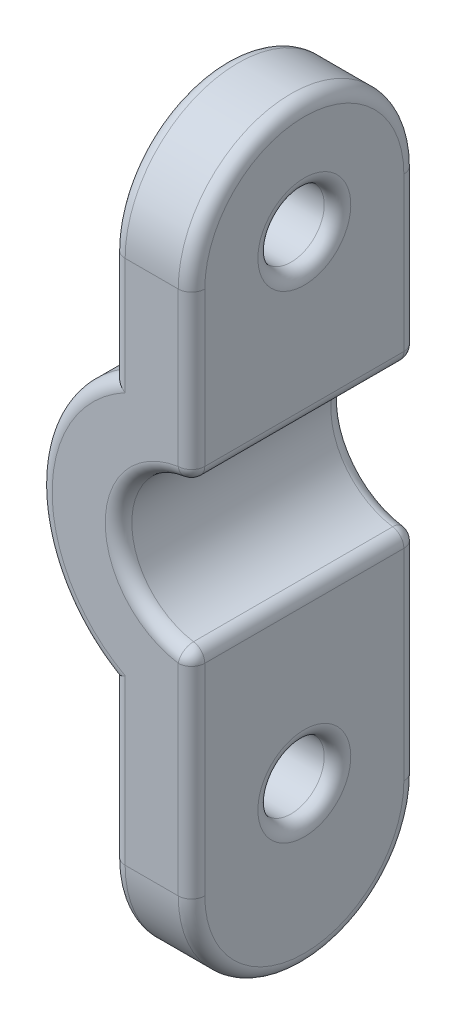
ISO-10303-21;
HEADER;
FILE_DESCRIPTION(('STEP AP214'),'2;1');
FILE_NAME('part.step','',(''),(''),'','','');
FILE_SCHEMA(('AUTOMOTIVE_DESIGN { 1 0 10303 214 1 1 1 1 }'));
ENDSEC;
DATA;
#1=APPLICATION_CONTEXT('core data for automotive mechanical design processes');
#2=APPLICATION_PROTOCOL_DEFINITION('international standard','automotive_design',2000,#1);
#3=PRODUCT_CONTEXT('',#1,'mechanical');
#4=PRODUCT('Part','Part','',(#3));
#5=PRODUCT_RELATED_PRODUCT_CATEGORY('part','',(#4));
#6=PRODUCT_DEFINITION_FORMATION('','',#4);
#7=PRODUCT_DEFINITION_CONTEXT('part definition',#1,'design');
#8=PRODUCT_DEFINITION('design','',#6,#7);
#9=PRODUCT_DEFINITION_SHAPE('','',#8);
#10=(LENGTH_UNIT() NAMED_UNIT(*) SI_UNIT(.MILLI.,.METRE.));
#11=(NAMED_UNIT(*) PLANE_ANGLE_UNIT() SI_UNIT($,.RADIAN.));
#12=(NAMED_UNIT(*) SI_UNIT($,.STERADIAN.) SOLID_ANGLE_UNIT());
#13=UNCERTAINTY_MEASURE_WITH_UNIT(LENGTH_MEASURE(1.E-05),#10,'distance_accuracy_value','');
#14=(GEOMETRIC_REPRESENTATION_CONTEXT(3) GLOBAL_UNCERTAINTY_ASSIGNED_CONTEXT((#13)) GLOBAL_UNIT_ASSIGNED_CONTEXT((#10,
#11,#12)) REPRESENTATION_CONTEXT('',''));
#15=CARTESIAN_POINT('',(0.,0.,0.));
#16=DIRECTION('',(0.,0.,1.));
#17=DIRECTION('',(1.,0.,0.));
#18=AXIS2_PLACEMENT_3D('',#15,#16,#17);
#19=CARTESIAN_POINT('',(-2.75,0.,12.5));
#20=DIRECTION('',(-1.,0.,0.));
#21=DIRECTION('',(0.,-1.,0.));
#22=AXIS2_PLACEMENT_3D('',#19,#20,#21);
#23=PLANE('',#22);
#24=CARTESIAN_POINT('',(-2.75,-8.10000000000002,6.25000000000001));
#25=DIRECTION('',(-1.,0.,0.));
#26=DIRECTION('',(0.,-1.,0.));
#27=AXIS2_PLACEMENT_3D('',#24,#25,#26);
#28=CIRCLE('',#27,1.75);
#29=CARTESIAN_POINT('',(-2.74999999999999,-9.85000000000002,6.25000000000001));
#30=VERTEX_POINT('',#29);
#31=EDGE_CURVE('E221',#30,#30,#28,.T.);
#32=ORIENTED_EDGE('',*,*,#31,.T.);
#33=EDGE_LOOP('',(#32));
#34=FACE_BOUND('',#33,.T.);
#35=DIRECTION('',(0.,0.,1.));
#36=VECTOR('',#35,1.);
#37=CARTESIAN_POINT('',(-2.75,-2.31130814466627,10.5));
#38=LINE('',#37,#36);
#39=CARTESIAN_POINT('',(-2.75,-2.31130814466627,2.5));
#40=VERTEX_POINT('',#39);
#41=CARTESIAN_POINT('',(-2.75,-2.31130814466627,10.));
#42=VERTEX_POINT('',#41);
#43=EDGE_CURVE('E263',#40,#42,#38,.T.);
#44=ORIENTED_EDGE('',*,*,#43,.T.);
#45=DIRECTION('',(0.,1.,0.));
#46=VECTOR('',#45,1.);
#47=CARTESIAN_POINT('',(-2.74999999999999,-9.89999999999998,10.));
#48=LINE('',#47,#46);
#49=CARTESIAN_POINT('',(-2.74999999999999,-9.89999999999998,10.));
#50=VERTEX_POINT('',#49);
#51=EDGE_CURVE('E267',#42,#50,#48,.F.);
#52=ORIENTED_EDGE('',*,*,#51,.T.);
#53=CARTESIAN_POINT('',(-2.74999999999999,-9.89999999999998,6.25));
#54=DIRECTION('',(-1.,0.,0.));
#55=DIRECTION('',(0.,-1.,0.));
#56=AXIS2_PLACEMENT_3D('',#53,#54,#55);
#57=CIRCLE('',#56,3.75);
#58=CARTESIAN_POINT('',(-2.74999999999999,-9.89999999999998,2.5));
#59=VERTEX_POINT('',#58);
#60=EDGE_CURVE('E265',#50,#59,#57,.F.);
#61=ORIENTED_EDGE('',*,*,#60,.T.);
#62=DIRECTION('',(0.,1.,0.));
#63=VECTOR('',#62,1.);
#64=CARTESIAN_POINT('',(-2.75,0.,2.5));
#65=LINE('',#64,#63);
#66=EDGE_CURVE('E261',#59,#40,#65,.T.);
#67=ORIENTED_EDGE('',*,*,#66,.T.);
#68=EDGE_LOOP('',(#44,#52,#61,#67));
#69=FACE_BOUND('',#68,.T.);
#70=ADVANCED_FACE('F65',(#34,#69),#23,.F.);
#71=CARTESIAN_POINT('',(-2.75,0.,12.5));
#72=DIRECTION('',(1.,0.,0.));
#73=DIRECTION('',(0.,1.,0.));
#74=AXIS2_PLACEMENT_3D('',#71,#72,#73);
#75=PLANE('',#74);
#76=CARTESIAN_POINT('',(-2.75,9.89999999999998,6.25000000000001));
#77=DIRECTION('',(1.,0.,0.));
#78=DIRECTION('',(0.,1.,0.));
#79=AXIS2_PLACEMENT_3D('',#76,#77,#78);
#80=CIRCLE('',#79,1.75);
#81=CARTESIAN_POINT('',(-2.75,11.65,6.25000000000001));
#82=VERTEX_POINT('',#81);
#83=EDGE_CURVE('E282',#82,#82,#80,.F.);
#84=ORIENTED_EDGE('',*,*,#83,.T.);
#85=EDGE_LOOP('',(#84));
#86=FACE_BOUND('',#85,.T.);
#87=CARTESIAN_POINT('',(-2.75,9.89999999999998,6.25000000000001));
#88=DIRECTION('',(1.,0.,0.));
#89=DIRECTION('',(0.,1.,0.));
#90=AXIS2_PLACEMENT_3D('',#87,#88,#89);
#91=CIRCLE('',#90,3.75);
#92=CARTESIAN_POINT('',(-2.75,9.89999999999998,2.50000000000001));
#93=VERTEX_POINT('',#92);
#94=CARTESIAN_POINT('',(-2.75,9.89999999999998,10.));
#95=VERTEX_POINT('',#94);
#96=EDGE_CURVE('E277',#93,#95,#91,.T.);
#97=ORIENTED_EDGE('',*,*,#96,.T.);
#98=DIRECTION('',(0.,-1.,0.));
#99=VECTOR('',#98,1.);
#100=CARTESIAN_POINT('',(-2.75,0.,10.));
#101=LINE('',#100,#99);
#102=CARTESIAN_POINT('',(-2.75,4.11130814466629,10.));
#103=VERTEX_POINT('',#102);
#104=EDGE_CURVE('E279',#95,#103,#101,.T.);
#105=ORIENTED_EDGE('',*,*,#104,.T.);
#106=DIRECTION('',(0.,0.,-1.));
#107=VECTOR('',#106,1.);
#108=CARTESIAN_POINT('',(-2.75,4.11130814466629,12.5));
#109=LINE('',#108,#107);
#110=CARTESIAN_POINT('',(-2.75,4.11130814466629,2.5));
#111=VERTEX_POINT('',#110);
#112=EDGE_CURVE('E275',#103,#111,#109,.T.);
#113=ORIENTED_EDGE('',*,*,#112,.T.);
#114=DIRECTION('',(0.,-1.,0.));
#115=VECTOR('',#114,1.);
#116=CARTESIAN_POINT('',(-2.75,9.89999999999998,2.50000000000001));
#117=LINE('',#116,#115);
#118=EDGE_CURVE('E273',#111,#93,#117,.F.);
#119=ORIENTED_EDGE('',*,*,#118,.T.);
#120=EDGE_LOOP('',(#97,#105,#113,#119));
#121=FACE_BOUND('',#120,.T.);
#122=ADVANCED_FACE('F446',(#86,#121),#75,.T.);
#123=CARTESIAN_POINT('',(-2.75,0.900000000000008,12.5));
#124=DIRECTION('',(0.,0.,-1.));
#125=DIRECTION('',(-1.,0.,0.));
#126=AXIS2_PLACEMENT_3D('',#123,#124,#125);
#127=CYLINDRICAL_SURFACE('',#126,2.75);
#128=DIRECTION('',(0.,0.,-1.));
#129=VECTOR('',#128,1.);
#130=CARTESIAN_POINT('',(-3.17307692307692,3.61726073779455,12.5));
#131=LINE('',#130,#129);
#132=CARTESIAN_POINT('',(-3.17307692307692,3.61726073779455,2.5));
#133=VERTEX_POINT('',#132);
#134=CARTESIAN_POINT('',(-3.17307692307692,3.61726073779455,10.));
#135=VERTEX_POINT('',#134);
#136=EDGE_CURVE('E93',#133,#135,#131,.F.);
#137=ORIENTED_EDGE('',*,*,#136,.T.);
#138=CARTESIAN_POINT('',(-2.75,0.900000000000008,10.));
#139=DIRECTION('',(0.,0.,1.));
#140=DIRECTION('',(0.,-1.,0.));
#141=AXIS2_PLACEMENT_3D('',#138,#139,#140);
#142=CIRCLE('',#141,2.75);
#143=CARTESIAN_POINT('',(-3.17307692307692,-1.81726073779454,10.));
#144=VERTEX_POINT('',#143);
#145=EDGE_CURVE('E88',#135,#144,#142,.T.);
#146=ORIENTED_EDGE('',*,*,#145,.T.);
#147=DIRECTION('',(0.,0.,-1.));
#148=VECTOR('',#147,1.);
#149=CARTESIAN_POINT('',(-3.17307692307692,-1.81726073779454,12.5));
#150=LINE('',#149,#148);
#151=CARTESIAN_POINT('',(-3.17307692307692,-1.81726073779454,2.5));
#152=VERTEX_POINT('',#151);
#153=EDGE_CURVE('E321',#144,#152,#150,.T.);
#154=ORIENTED_EDGE('',*,*,#153,.T.);
#155=CARTESIAN_POINT('',(-2.75,0.900000000000008,2.5));
#156=DIRECTION('',(0.,0.,1.));
#157=DIRECTION('',(0.,-1.,0.));
#158=AXIS2_PLACEMENT_3D('',#155,#156,#157);
#159=CIRCLE('',#158,2.75);
#160=EDGE_CURVE('E318',#152,#133,#159,.F.);
#161=ORIENTED_EDGE('',*,*,#160,.T.);
#162=EDGE_LOOP('',(#137,#146,#154,#161));
#163=FACE_BOUND('',#162,.T.);
#164=ADVANCED_FACE('F452',(#163),#127,.F.);
#165=CARTESIAN_POINT('',(-8.5,9.89999999999998,6.25000000000001));
#166=DIRECTION('',(1.,0.,0.));
#167=DIRECTION('',(0.,0.,-1.));
#168=AXIS2_PLACEMENT_3D('',#165,#166,#167);
#169=CYLINDRICAL_SURFACE('',#168,4.25);
#170=DIRECTION('',(1.,0.,0.));
#171=VECTOR('',#170,1.);
#172=CARTESIAN_POINT('',(-8.5,9.89999999999998,10.5));
#173=LINE('',#172,#171);
#174=CARTESIAN_POINT('',(-5.25,9.89999999999998,10.5));
#175=VERTEX_POINT('',#174);
#176=CARTESIAN_POINT('',(-3.25,9.89999999999998,10.5));
#177=VERTEX_POINT('',#176);
#178=EDGE_CURVE('E236',#175,#177,#173,.T.);
#179=ORIENTED_EDGE('',*,*,#178,.T.);
#180=CARTESIAN_POINT('',(-3.25,9.89999999999998,6.25000000000001));
#181=DIRECTION('',(1.,0.,0.));
#182=DIRECTION('',(0.,1.,0.));
#183=AXIS2_PLACEMENT_3D('',#180,#181,#182);
#184=CIRCLE('',#183,4.25);
#185=CARTESIAN_POINT('',(-3.25,9.89999999999998,2.00000000000001));
#186=VERTEX_POINT('',#185);
#187=EDGE_CURVE('E287',#177,#186,#184,.F.);
#188=ORIENTED_EDGE('',*,*,#187,.T.);
#189=DIRECTION('',(1.,0.,0.));
#190=VECTOR('',#189,1.);
#191=CARTESIAN_POINT('',(-8.5,9.89999999999998,2.00000000000001));
#192=LINE('',#191,#190);
#193=CARTESIAN_POINT('',(-5.25,9.89999999999998,2.00000000000001));
#194=VERTEX_POINT('',#193);
#195=EDGE_CURVE('E240',#194,#186,#192,.T.);
#196=ORIENTED_EDGE('',*,*,#195,.F.);
#197=CARTESIAN_POINT('',(-5.25,9.89999999999998,6.25000000000001));
#198=DIRECTION('',(1.,0.,0.));
#199=DIRECTION('',(0.,1.,0.));
#200=AXIS2_PLACEMENT_3D('',#197,#198,#199);
#201=CIRCLE('',#200,4.25);
#202=EDGE_CURVE('E285',#194,#175,#201,.T.);
#203=ORIENTED_EDGE('',*,*,#202,.T.);
#204=EDGE_LOOP('',(#179,#188,#196,#203));
#205=FACE_BOUND('',#204,.T.);
#206=ADVANCED_FACE('F475',(#205),#169,.T.);
#207=CARTESIAN_POINT('',(-8.5,-9.89999999999998,6.25));
#208=DIRECTION('',(1.,0.,0.));
#209=DIRECTION('',(0.,0.,-1.));
#210=AXIS2_PLACEMENT_3D('',#207,#208,#209);
#211=CYLINDRICAL_SURFACE('',#210,4.25);
#212=DIRECTION('',(1.,0.,0.));
#213=VECTOR('',#212,1.);
#214=CARTESIAN_POINT('',(-8.5,-9.89999999999998,2.));
#215=LINE('',#214,#213);
#216=CARTESIAN_POINT('',(-5.24999999999999,-9.89999999999998,2.));
#217=VERTEX_POINT('',#216);
#218=CARTESIAN_POINT('',(-3.24999999999999,-9.89999999999998,2.));
#219=VERTEX_POINT('',#218);
#220=EDGE_CURVE('E251',#217,#219,#215,.T.);
#221=ORIENTED_EDGE('',*,*,#220,.T.);
#222=CARTESIAN_POINT('',(-3.24999999999999,-9.89999999999998,6.25));
#223=DIRECTION('',(-1.,0.,0.));
#224=DIRECTION('',(0.,-1.,0.));
#225=AXIS2_PLACEMENT_3D('',#222,#223,#224);
#226=CIRCLE('',#225,4.25);
#227=CARTESIAN_POINT('',(-3.24999999999999,-9.89999999999998,10.5));
#228=VERTEX_POINT('',#227);
#229=EDGE_CURVE('E220',#219,#228,#226,.T.);
#230=ORIENTED_EDGE('',*,*,#229,.T.);
#231=DIRECTION('',(1.,0.,0.));
#232=VECTOR('',#231,1.);
#233=CARTESIAN_POINT('',(-8.5,-9.89999999999998,10.5));
#234=LINE('',#233,#232);
#235=CARTESIAN_POINT('',(-5.24999999999999,-9.89999999999998,10.5));
#236=VERTEX_POINT('',#235);
#237=EDGE_CURVE('E227',#236,#228,#234,.T.);
#238=ORIENTED_EDGE('',*,*,#237,.F.);
#239=CARTESIAN_POINT('',(-5.24999999999999,-9.89999999999998,6.25));
#240=DIRECTION('',(-1.,0.,0.));
#241=DIRECTION('',(0.,-1.,0.));
#242=AXIS2_PLACEMENT_3D('',#239,#240,#241);
#243=CIRCLE('',#242,4.25);
#244=EDGE_CURVE('E212',#236,#217,#243,.F.);
#245=ORIENTED_EDGE('',*,*,#244,.T.);
#246=EDGE_LOOP('',(#221,#230,#238,#245));
#247=FACE_BOUND('',#246,.T.);
#248=ADVANCED_FACE('F234',(#247),#211,.T.);
#249=CARTESIAN_POINT('',(-8.5,0.,2.));
#250=DIRECTION('',(0.,0.,1.));
#251=DIRECTION('',(0.,-1.,0.));
#252=AXIS2_PLACEMENT_3D('',#249,#250,#251);
#253=PLANE('',#252);
#254=CARTESIAN_POINT('',(-2.75,0.900000000000008,2.));
#255=DIRECTION('',(0.,0.,1.));
#256=DIRECTION('',(0.,-1.,0.));
#257=AXIS2_PLACEMENT_3D('',#254,#255,#256);
#258=CIRCLE('',#257,3.25);
#259=CARTESIAN_POINT('',(-3.25,4.11130814466629,2.));
#260=VERTEX_POINT('',#259);
#261=CARTESIAN_POINT('',(-3.25,-2.31130814466627,2.));
#262=VERTEX_POINT('',#261);
#263=EDGE_CURVE('E314',#260,#262,#258,.T.);
#264=ORIENTED_EDGE('',*,*,#263,.T.);
#265=DIRECTION('',(0.,1.,0.));
#266=VECTOR('',#265,1.);
#267=CARTESIAN_POINT('',(-3.25,0.,2.));
#268=LINE('',#267,#266);
#269=EDGE_CURVE('E316',#262,#219,#268,.F.);
#270=ORIENTED_EDGE('',*,*,#269,.T.);
#271=ORIENTED_EDGE('',*,*,#220,.F.);
#272=DIRECTION('',(0.,1.,0.));
#273=VECTOR('',#272,1.);
#274=CARTESIAN_POINT('',(-5.25,-4.00535421758714,2.));
#275=LINE('',#274,#273);
#276=CARTESIAN_POINT('',(-5.24999999999997,-3.71654632815486,2.));
#277=VERTEX_POINT('',#276);
#278=EDGE_CURVE('E308',#217,#277,#275,.T.);
#279=ORIENTED_EDGE('',*,*,#278,.T.);
#280=CARTESIAN_POINT('',(-2.75,0.900000000000008,2.));
#281=DIRECTION('',(0.,0.,1.));
#282=DIRECTION('',(0.,-1.,0.));
#283=AXIS2_PLACEMENT_3D('',#280,#281,#282);
#284=CIRCLE('',#283,5.25);
#285=CARTESIAN_POINT('',(-5.24999999999997,5.51654632815487,2.));
#286=VERTEX_POINT('',#285);
#287=EDGE_CURVE('E306',#277,#286,#284,.F.);
#288=ORIENTED_EDGE('',*,*,#287,.T.);
#289=DIRECTION('',(0.,-1.,0.));
#290=VECTOR('',#289,1.);
#291=CARTESIAN_POINT('',(-5.25,0.,2.));
#292=LINE('',#291,#290);
#293=EDGE_CURVE('E310',#286,#194,#292,.F.);
#294=ORIENTED_EDGE('',*,*,#293,.T.);
#295=ORIENTED_EDGE('',*,*,#195,.T.);
#296=DIRECTION('',(0.,-1.,0.));
#297=VECTOR('',#296,1.);
#298=CARTESIAN_POINT('',(-3.25,3.65000000000001,2.));
#299=LINE('',#298,#297);
#300=EDGE_CURVE('E312',#186,#260,#299,.T.);
#301=ORIENTED_EDGE('',*,*,#300,.T.);
#302=EDGE_LOOP('',(#264,#270,#271,#279,#288,#294,#295,#301));
#303=FACE_BOUND('',#302,.T.);
#304=ADVANCED_FACE('F545',(#303),#253,.F.);
#305=CARTESIAN_POINT('',(-8.5,0.,10.5));
#306=DIRECTION('',(0.,0.,1.));
#307=DIRECTION('',(0.,-1.,0.));
#308=AXIS2_PLACEMENT_3D('',#305,#306,#307);
#309=PLANE('',#308);
#310=ORIENTED_EDGE('',*,*,#237,.T.);
#311=DIRECTION('',(0.,1.,0.));
#312=VECTOR('',#311,1.);
#313=CARTESIAN_POINT('',(-3.25,-1.84999999999999,10.5));
#314=LINE('',#313,#312);
#315=CARTESIAN_POINT('',(-3.25,-2.31130814466627,10.5));
#316=VERTEX_POINT('',#315);
#317=EDGE_CURVE('E259',#228,#316,#314,.T.);
#318=ORIENTED_EDGE('',*,*,#317,.T.);
#319=CARTESIAN_POINT('',(-2.75,0.900000000000008,10.5));
#320=DIRECTION('',(0.,0.,1.));
#321=DIRECTION('',(0.,-1.,0.));
#322=AXIS2_PLACEMENT_3D('',#319,#320,#321);
#323=CIRCLE('',#322,3.25);
#324=CARTESIAN_POINT('',(-3.25,4.11130814466629,10.5));
#325=VERTEX_POINT('',#324);
#326=EDGE_CURVE('E231',#316,#325,#323,.F.);
#327=ORIENTED_EDGE('',*,*,#326,.T.);
#328=DIRECTION('',(0.,-1.,0.));
#329=VECTOR('',#328,1.);
#330=CARTESIAN_POINT('',(-3.25,0.,10.5));
#331=LINE('',#330,#329);
#332=EDGE_CURVE('E257',#325,#177,#331,.F.);
#333=ORIENTED_EDGE('',*,*,#332,.T.);
#334=ORIENTED_EDGE('',*,*,#178,.F.);
#335=DIRECTION('',(0.,-1.,0.));
#336=VECTOR('',#335,1.);
#337=CARTESIAN_POINT('',(-5.25,5.80535421758715,10.5));
#338=LINE('',#337,#336);
#339=CARTESIAN_POINT('',(-5.24999999999997,5.51654632815487,10.5));
#340=VERTEX_POINT('',#339);
#341=EDGE_CURVE('E232',#175,#340,#338,.T.);
#342=ORIENTED_EDGE('',*,*,#341,.T.);
#343=CARTESIAN_POINT('',(-2.75,0.900000000000008,10.5));
#344=DIRECTION('',(0.,0.,1.));
#345=DIRECTION('',(0.,-1.,0.));
#346=AXIS2_PLACEMENT_3D('',#343,#344,#345);
#347=CIRCLE('',#346,5.25);
#348=CARTESIAN_POINT('',(-5.24999999999997,-3.71654632815486,10.5));
#349=VERTEX_POINT('',#348);
#350=EDGE_CURVE('E230',#340,#349,#347,.T.);
#351=ORIENTED_EDGE('',*,*,#350,.T.);
#352=DIRECTION('',(0.,1.,0.));
#353=VECTOR('',#352,1.);
#354=CARTESIAN_POINT('',(-5.25,0.,10.5));
#355=LINE('',#354,#353);
#356=EDGE_CURVE('E202',#349,#236,#355,.F.);
#357=ORIENTED_EDGE('',*,*,#356,.T.);
#358=EDGE_LOOP('',(#310,#318,#327,#333,#334,#342,#351,#357));
#359=FACE_BOUND('',#358,.T.);
#360=ADVANCED_FACE('F225',(#359),#309,.T.);
#361=CARTESIAN_POINT('',(-8.5,-8.10000000000002,6.25000000000001));
#362=DIRECTION('',(1.,0.,0.));
#363=DIRECTION('',(0.,0.,-1.));
#364=AXIS2_PLACEMENT_3D('',#361,#362,#363);
#365=CYLINDRICAL_SURFACE('',#364,1.25);
#366=CARTESIAN_POINT('',(-3.25,-8.10000000000002,6.25000000000001));
#367=DIRECTION('',(-1.,0.,0.));
#368=DIRECTION('',(0.,-1.,0.));
#369=AXIS2_PLACEMENT_3D('',#366,#367,#368);
#370=CIRCLE('',#369,1.25);
#371=CARTESIAN_POINT('',(-3.24999999999999,-9.35000000000002,6.25000000000001));
#372=VERTEX_POINT('',#371);
#373=EDGE_CURVE('E327',#372,#372,#370,.F.);
#374=ORIENTED_EDGE('',*,*,#373,.T.);
#375=EDGE_LOOP('',(#374));
#376=FACE_BOUND('',#375,.T.);
#377=CARTESIAN_POINT('',(-5.25,-8.10000000000002,6.25000000000001));
#378=DIRECTION('',(-1.,0.,0.));
#379=DIRECTION('',(0.,-1.,0.));
#380=AXIS2_PLACEMENT_3D('',#377,#378,#379);
#381=CIRCLE('',#380,1.25);
#382=CARTESIAN_POINT('',(-5.25,-9.35000000000002,6.25000000000001));
#383=VERTEX_POINT('',#382);
#384=EDGE_CURVE('E324',#383,#383,#381,.T.);
#385=ORIENTED_EDGE('',*,*,#384,.T.);
#386=EDGE_LOOP('',(#385));
#387=FACE_BOUND('',#386,.T.);
#388=ADVANCED_FACE('F468',(#376,#387),#365,.F.);
#389=CARTESIAN_POINT('',(-2.75,0.900000000000008,12.5));
#390=DIRECTION('',(0.,0.,-1.));
#391=DIRECTION('',(-1.,0.,0.));
#392=AXIS2_PLACEMENT_3D('',#389,#390,#391);
#393=CYLINDRICAL_SURFACE('',#392,5.75);
#394=DIRECTION('',(0.,0.,-1.));
#395=VECTOR('',#394,1.);
#396=CARTESIAN_POINT('',(-5.75,5.80535421758715,12.5));
#397=LINE('',#396,#395);
#398=CARTESIAN_POINT('',(-5.75,5.80535421758715,10.));
#399=VERTEX_POINT('',#398);
#400=CARTESIAN_POINT('',(-5.75,5.80535421758715,2.5));
#401=VERTEX_POINT('',#400);
#402=EDGE_CURVE('E250',#399,#401,#397,.T.);
#403=ORIENTED_EDGE('',*,*,#402,.T.);
#404=CARTESIAN_POINT('',(-2.75,0.900000000000008,2.5));
#405=DIRECTION('',(0.,0.,1.));
#406=DIRECTION('',(0.,-1.,0.));
#407=AXIS2_PLACEMENT_3D('',#404,#405,#406);
#408=CIRCLE('',#407,5.75);
#409=CARTESIAN_POINT('',(-5.75,-4.00535421758714,2.5));
#410=VERTEX_POINT('',#409);
#411=EDGE_CURVE('E12',#401,#410,#408,.T.);
#412=ORIENTED_EDGE('',*,*,#411,.T.);
#413=DIRECTION('',(0.,0.,-1.));
#414=VECTOR('',#413,1.);
#415=CARTESIAN_POINT('',(-5.75,-4.00535421758714,12.5));
#416=LINE('',#415,#414);
#417=CARTESIAN_POINT('',(-5.75,-4.00535421758714,10.));
#418=VERTEX_POINT('',#417);
#419=EDGE_CURVE('E247',#418,#410,#416,.T.);
#420=ORIENTED_EDGE('',*,*,#419,.F.);
#421=CARTESIAN_POINT('',(-2.75,0.900000000000008,10.));
#422=DIRECTION('',(0.,0.,1.));
#423=DIRECTION('',(0.,-1.,0.));
#424=AXIS2_PLACEMENT_3D('',#421,#422,#423);
#425=CIRCLE('',#424,5.75);
#426=EDGE_CURVE('E80',#418,#399,#425,.F.);
#427=ORIENTED_EDGE('',*,*,#426,.T.);
#428=EDGE_LOOP('',(#403,#412,#420,#427));
#429=FACE_BOUND('',#428,.T.);
#430=ADVANCED_FACE('F465',(#429),#393,.T.);
#431=CARTESIAN_POINT('',(-5.75000000000001,0.,12.5));
#432=DIRECTION('',(1.,0.,0.));
#433=DIRECTION('',(0.,1.,0.));
#434=AXIS2_PLACEMENT_3D('',#431,#432,#433);
#435=PLANE('',#434);
#436=CARTESIAN_POINT('',(-5.75,9.89999999999998,6.25000000000001));
#437=DIRECTION('',(1.,0.,0.));
#438=DIRECTION('',(0.,1.,0.));
#439=AXIS2_PLACEMENT_3D('',#436,#437,#438);
#440=CIRCLE('',#439,1.75);
#441=CARTESIAN_POINT('',(-5.75,11.65,6.25000000000001));
#442=VERTEX_POINT('',#441);
#443=EDGE_CURVE('E303',#442,#442,#440,.T.);
#444=ORIENTED_EDGE('',*,*,#443,.T.);
#445=EDGE_LOOP('',(#444));
#446=FACE_BOUND('',#445,.T.);
#447=CARTESIAN_POINT('',(-5.75,9.89999999999998,6.25000000000001));
#448=DIRECTION('',(1.,0.,0.));
#449=DIRECTION('',(0.,1.,0.));
#450=AXIS2_PLACEMENT_3D('',#447,#448,#449);
#451=CIRCLE('',#450,3.75);
#452=CARTESIAN_POINT('',(-5.75,9.89999999999998,10.));
#453=VERTEX_POINT('',#452);
#454=CARTESIAN_POINT('',(-5.75,9.89999999999998,2.50000000000001));
#455=VERTEX_POINT('',#454);
#456=EDGE_CURVE('E299',#453,#455,#451,.F.);
#457=ORIENTED_EDGE('',*,*,#456,.T.);
#458=DIRECTION('',(0.,-1.,0.));
#459=VECTOR('',#458,1.);
#460=CARTESIAN_POINT('',(-5.75000000000001,0.,2.50000000000001));
#461=LINE('',#460,#459);
#462=EDGE_CURVE('E301',#455,#401,#461,.T.);
#463=ORIENTED_EDGE('',*,*,#462,.T.);
#464=ORIENTED_EDGE('',*,*,#402,.F.);
#465=DIRECTION('',(0.,-1.,0.));
#466=VECTOR('',#465,1.);
#467=CARTESIAN_POINT('',(-5.75,9.89999999999998,10.));
#468=LINE('',#467,#466);
#469=EDGE_CURVE('E297',#399,#453,#468,.F.);
#470=ORIENTED_EDGE('',*,*,#469,.T.);
#471=EDGE_LOOP('',(#457,#463,#464,#470));
#472=FACE_BOUND('',#471,.T.);
#473=ADVANCED_FACE('F463',(#446,#472),#435,.F.);
#474=CARTESIAN_POINT('',(-5.75,0.,12.5));
#475=DIRECTION('',(-1.,0.,0.));
#476=DIRECTION('',(0.,-1.,0.));
#477=AXIS2_PLACEMENT_3D('',#474,#475,#476);
#478=PLANE('',#477);
#479=CARTESIAN_POINT('',(-5.75,-8.10000000000002,6.25000000000001));
#480=DIRECTION('',(-1.,0.,0.));
#481=DIRECTION('',(0.,-1.,0.));
#482=AXIS2_PLACEMENT_3D('',#479,#480,#481);
#483=CIRCLE('',#482,1.75);
#484=CARTESIAN_POINT('',(-5.74999999999999,-9.85000000000002,6.25000000000001));
#485=VERTEX_POINT('',#484);
#486=EDGE_CURVE('E294',#485,#485,#483,.F.);
#487=ORIENTED_EDGE('',*,*,#486,.T.);
#488=EDGE_LOOP('',(#487));
#489=FACE_BOUND('',#488,.T.);
#490=CARTESIAN_POINT('',(-5.74999999999999,-9.89999999999998,6.25));
#491=DIRECTION('',(-1.,0.,0.));
#492=DIRECTION('',(0.,-1.,0.));
#493=AXIS2_PLACEMENT_3D('',#490,#491,#492);
#494=CIRCLE('',#493,3.75);
#495=CARTESIAN_POINT('',(-5.74999999999999,-9.89999999999998,2.5));
#496=VERTEX_POINT('',#495);
#497=CARTESIAN_POINT('',(-5.74999999999999,-9.89999999999998,10.));
#498=VERTEX_POINT('',#497);
#499=EDGE_CURVE('E291',#496,#498,#494,.T.);
#500=ORIENTED_EDGE('',*,*,#499,.T.);
#501=DIRECTION('',(0.,1.,0.));
#502=VECTOR('',#501,1.);
#503=CARTESIAN_POINT('',(-5.75,0.,10.));
#504=LINE('',#503,#502);
#505=EDGE_CURVE('E205',#498,#418,#504,.T.);
#506=ORIENTED_EDGE('',*,*,#505,.T.);
#507=ORIENTED_EDGE('',*,*,#419,.T.);
#508=DIRECTION('',(0.,1.,0.));
#509=VECTOR('',#508,1.);
#510=CARTESIAN_POINT('',(-5.74999999999999,-9.89999999999998,2.5));
#511=LINE('',#510,#509);
#512=EDGE_CURVE('E289',#410,#496,#511,.F.);
#513=ORIENTED_EDGE('',*,*,#512,.T.);
#514=EDGE_LOOP('',(#500,#506,#507,#513));
#515=FACE_BOUND('',#514,.T.);
#516=ADVANCED_FACE('F459',(#489,#515),#478,.T.);
#517=CARTESIAN_POINT('',(-8.5,9.89999999999998,6.25000000000001));
#518=DIRECTION('',(1.,0.,0.));
#519=DIRECTION('',(0.,0.,-1.));
#520=AXIS2_PLACEMENT_3D('',#517,#518,#519);
#521=CYLINDRICAL_SURFACE('',#520,1.25);
#522=CARTESIAN_POINT('',(-3.25,9.89999999999998,6.25000000000001));
#523=DIRECTION('',(1.,0.,0.));
#524=DIRECTION('',(0.,1.,0.));
#525=AXIS2_PLACEMENT_3D('',#522,#523,#524);
#526=CIRCLE('',#525,1.25);
#527=CARTESIAN_POINT('',(-3.25,11.15,6.25000000000001));
#528=VERTEX_POINT('',#527);
#529=EDGE_CURVE('E333',#528,#528,#526,.T.);
#530=ORIENTED_EDGE('',*,*,#529,.T.);
#531=EDGE_LOOP('',(#530));
#532=FACE_BOUND('',#531,.T.);
#533=CARTESIAN_POINT('',(-5.25,9.89999999999998,6.25000000000001));
#534=DIRECTION('',(1.,0.,0.));
#535=DIRECTION('',(0.,1.,0.));
#536=AXIS2_PLACEMENT_3D('',#533,#534,#535);
#537=CIRCLE('',#536,1.25);
#538=CARTESIAN_POINT('',(-5.25,11.15,6.25000000000001));
#539=VERTEX_POINT('',#538);
#540=EDGE_CURVE('E330',#539,#539,#537,.F.);
#541=ORIENTED_EDGE('',*,*,#540,.T.);
#542=EDGE_LOOP('',(#541));
#543=FACE_BOUND('',#542,.T.);
#544=ADVANCED_FACE('F462',(#532,#543),#521,.F.);
#545=CARTESIAN_POINT('',(-3.25,0.,2.5));
#546=DIRECTION('',(0.,1.,0.));
#547=DIRECTION('',(-1.,0.,0.));
#548=AXIS2_PLACEMENT_3D('',#545,#546,#547);
#549=CYLINDRICAL_SURFACE('',#548,0.5);
#550=CARTESIAN_POINT('',(-3.25,4.11130814466629,2.5));
#551=DIRECTION('',(0.,-1.,0.));
#552=DIRECTION('',(0.,0.,-1.));
#553=AXIS2_PLACEMENT_3D('',#550,#551,#552);
#554=CIRCLE('',#553,0.5);
#555=EDGE_CURVE('E243',#260,#111,#554,.T.);
#556=ORIENTED_EDGE('',*,*,#555,.F.);
#557=ORIENTED_EDGE('',*,*,#300,.F.);
#558=CARTESIAN_POINT('',(-3.25,9.89999999999998,2.50000000000001));
#559=DIRECTION('',(0.,1.,0.));
#560=DIRECTION('',(0.,0.,1.));
#561=AXIS2_PLACEMENT_3D('',#558,#559,#560);
#562=CIRCLE('',#561,0.5);
#563=EDGE_CURVE('E237',#93,#186,#562,.T.);
#564=ORIENTED_EDGE('',*,*,#563,.F.);
#565=ORIENTED_EDGE('',*,*,#118,.F.);
#566=EDGE_LOOP('',(#556,#557,#564,#565));
#567=FACE_BOUND('',#566,.T.);
#568=ADVANCED_FACE('F525',(#567),#549,.T.);
#569=CARTESIAN_POINT('',(-3.25,9.89999999999998,6.25000000000001));
#570=DIRECTION('',(1.,0.,0.));
#571=DIRECTION('',(0.,1.,0.));
#572=AXIS2_PLACEMENT_3D('',#569,#570,#571);
#573=TOROIDAL_SURFACE('',#572,3.75,0.5);
#574=ORIENTED_EDGE('',*,*,#563,.T.);
#575=ORIENTED_EDGE('',*,*,#187,.F.);
#576=CARTESIAN_POINT('',(-3.25,9.89999999999998,10.));
#577=DIRECTION('',(0.,-1.,0.));
#578=DIRECTION('',(0.,0.,-1.));
#579=AXIS2_PLACEMENT_3D('',#576,#577,#578);
#580=CIRCLE('',#579,0.5);
#581=EDGE_CURVE('E372',#95,#177,#580,.T.);
#582=ORIENTED_EDGE('',*,*,#581,.F.);
#583=ORIENTED_EDGE('',*,*,#96,.F.);
#584=EDGE_LOOP('',(#574,#575,#582,#583));
#585=FACE_BOUND('',#584,.T.);
#586=ADVANCED_FACE('F522',(#585),#573,.T.);
#587=CARTESIAN_POINT('',(-3.25,4.11130814466629,2.5));
#588=DIRECTION('',(0.,0.,1.));
#589=DIRECTION('',(1.,0.,0.));
#590=AXIS2_PLACEMENT_3D('',#587,#588,#589);
#591=SPHERICAL_SURFACE('',#590,0.5);
#592=CARTESIAN_POINT('',(-3.25,4.11130814466629,2.5));
#593=DIRECTION('',(0.988094813743471,0.153846153846155,0.));
#594=DIRECTION('',(-0.153846153846155,0.988094813743471,0.));
#595=AXIS2_PLACEMENT_3D('',#592,#593,#594);
#596=CIRCLE('',#595,0.5);
#597=EDGE_CURVE('E366',#260,#133,#596,.F.);
#598=ORIENTED_EDGE('',*,*,#597,.F.);
#599=ORIENTED_EDGE('',*,*,#555,.T.);
#600=CARTESIAN_POINT('',(-3.25,4.11130814466629,2.5));
#601=DIRECTION('',(0.,0.,-1.));
#602=DIRECTION('',(-1.,0.,0.));
#603=AXIS2_PLACEMENT_3D('',#600,#601,#602);
#604=CIRCLE('',#603,0.5);
#605=EDGE_CURVE('E369',#133,#111,#604,.F.);
#606=ORIENTED_EDGE('',*,*,#605,.F.);
#607=EDGE_LOOP('',(#598,#599,#606));
#608=FACE_BOUND('',#607,.T.);
#609=ADVANCED_FACE('F518',(#608),#591,.T.);
#610=CARTESIAN_POINT('',(-3.25,0.,10.));
#611=DIRECTION('',(0.,-1.,0.));
#612=DIRECTION('',(1.,0.,0.));
#613=AXIS2_PLACEMENT_3D('',#610,#611,#612);
#614=CYLINDRICAL_SURFACE('',#613,0.5);
#615=ORIENTED_EDGE('',*,*,#581,.T.);
#616=ORIENTED_EDGE('',*,*,#332,.F.);
#617=CARTESIAN_POINT('',(-3.25,4.11130814466629,10.));
#618=DIRECTION('',(0.,-1.,0.));
#619=DIRECTION('',(0.,0.,-1.));
#620=AXIS2_PLACEMENT_3D('',#617,#618,#619);
#621=CIRCLE('',#620,0.5);
#622=EDGE_CURVE('E363',#103,#325,#621,.T.);
#623=ORIENTED_EDGE('',*,*,#622,.F.);
#624=ORIENTED_EDGE('',*,*,#104,.F.);
#625=EDGE_LOOP('',(#615,#616,#623,#624));
#626=FACE_BOUND('',#625,.T.);
#627=ADVANCED_FACE('F514',(#626),#614,.T.);
#628=CARTESIAN_POINT('',(-3.25,4.11130814466629,12.5));
#629=DIRECTION('',(0.,0.,-1.));
#630=DIRECTION('',(-1.,0.,0.));
#631=AXIS2_PLACEMENT_3D('',#628,#629,#630);
#632=CYLINDRICAL_SURFACE('',#631,0.5);
#633=ORIENTED_EDGE('',*,*,#605,.T.);
#634=ORIENTED_EDGE('',*,*,#112,.F.);
#635=CARTESIAN_POINT('',(-3.25,4.11130814466629,10.));
#636=DIRECTION('',(0.,0.,1.));
#637=DIRECTION('',(1.,0.,0.));
#638=AXIS2_PLACEMENT_3D('',#635,#636,#637);
#639=CIRCLE('',#638,0.5);
#640=EDGE_CURVE('E361',#135,#103,#639,.T.);
#641=ORIENTED_EDGE('',*,*,#640,.F.);
#642=ORIENTED_EDGE('',*,*,#136,.F.);
#643=EDGE_LOOP('',(#633,#634,#641,#642));
#644=FACE_BOUND('',#643,.T.);
#645=ADVANCED_FACE('F510',(#644),#632,.T.);
#646=CARTESIAN_POINT('',(-2.75,0.900000000000008,2.5));
#647=DIRECTION('',(0.,0.,1.));
#648=DIRECTION('',(0.,-1.,0.));
#649=AXIS2_PLACEMENT_3D('',#646,#647,#648);
#650=TOROIDAL_SURFACE('',#649,3.25,0.5);
#651=ORIENTED_EDGE('',*,*,#597,.T.);
#652=ORIENTED_EDGE('',*,*,#160,.F.);
#653=CARTESIAN_POINT('',(-3.25,-2.31130814466627,2.5));
#654=DIRECTION('',(0.988094813743471,-0.153846153846154,0.));
#655=DIRECTION('',(0.153846153846154,0.988094813743472,0.));
#656=AXIS2_PLACEMENT_3D('',#653,#654,#655);
#657=CIRCLE('',#656,0.5);
#658=EDGE_CURVE('E358',#262,#152,#657,.T.);
#659=ORIENTED_EDGE('',*,*,#658,.F.);
#660=ORIENTED_EDGE('',*,*,#263,.F.);
#661=EDGE_LOOP('',(#651,#652,#659,#660));
#662=FACE_BOUND('',#661,.T.);
#663=ADVANCED_FACE('F506',(#662),#650,.T.);
#664=CARTESIAN_POINT('',(-3.25,4.11130814466629,10.));
#665=DIRECTION('',(0.,0.,1.));
#666=DIRECTION('',(1.,0.,0.));
#667=AXIS2_PLACEMENT_3D('',#664,#665,#666);
#668=SPHERICAL_SURFACE('',#667,0.5);
#669=ORIENTED_EDGE('',*,*,#640,.T.);
#670=ORIENTED_EDGE('',*,*,#622,.T.);
#671=CARTESIAN_POINT('',(-3.25,4.11130814466629,10.));
#672=DIRECTION('',(0.988094813743471,0.153846153846155,0.));
#673=DIRECTION('',(-0.153846153846155,0.988094813743471,0.));
#674=AXIS2_PLACEMENT_3D('',#671,#672,#673);
#675=CIRCLE('',#674,0.5);
#676=EDGE_CURVE('E352',#135,#325,#675,.F.);
#677=ORIENTED_EDGE('',*,*,#676,.F.);
#678=EDGE_LOOP('',(#669,#670,#677));
#679=FACE_BOUND('',#678,.T.);
#680=ADVANCED_FACE('F502',(#679),#668,.T.);
#681=CARTESIAN_POINT('',(-3.25,-2.31130814466627,2.5));
#682=DIRECTION('',(0.,0.,1.));
#683=DIRECTION('',(1.,0.,0.));
#684=AXIS2_PLACEMENT_3D('',#681,#682,#683);
#685=SPHERICAL_SURFACE('',#684,0.5);
#686=CARTESIAN_POINT('',(-3.25,-2.31130814466627,2.5));
#687=DIRECTION('',(0.,0.,-1.));
#688=DIRECTION('',(-1.,0.,0.));
#689=AXIS2_PLACEMENT_3D('',#686,#687,#688);
#690=CIRCLE('',#689,0.5);
#691=EDGE_CURVE('E350',#40,#152,#690,.F.);
#692=ORIENTED_EDGE('',*,*,#691,.F.);
#693=CARTESIAN_POINT('',(-3.25,-2.31130814466627,2.5));
#694=DIRECTION('',(0.,1.,0.));
#695=DIRECTION('',(0.,0.,1.));
#696=AXIS2_PLACEMENT_3D('',#693,#694,#695);
#697=CIRCLE('',#696,0.5);
#698=EDGE_CURVE('E355',#262,#40,#697,.F.);
#699=ORIENTED_EDGE('',*,*,#698,.F.);
#700=ORIENTED_EDGE('',*,*,#658,.T.);
#701=EDGE_LOOP('',(#692,#699,#700));
#702=FACE_BOUND('',#701,.T.);
#703=ADVANCED_FACE('F498',(#702),#685,.T.);
#704=CARTESIAN_POINT('',(-3.25,0.,2.5));
#705=DIRECTION('',(0.,1.,0.));
#706=DIRECTION('',(-1.,0.,0.));
#707=AXIS2_PLACEMENT_3D('',#704,#705,#706);
#708=CYLINDRICAL_SURFACE('',#707,0.5);
#709=ORIENTED_EDGE('',*,*,#698,.T.);
#710=ORIENTED_EDGE('',*,*,#66,.F.);
#711=CARTESIAN_POINT('',(-3.24999999999999,-9.89999999999998,2.5));
#712=DIRECTION('',(0.,-1.,0.));
#713=DIRECTION('',(0.,0.,-1.));
#714=AXIS2_PLACEMENT_3D('',#711,#712,#713);
#715=CIRCLE('',#714,0.5);
#716=EDGE_CURVE('E347',#219,#59,#715,.T.);
#717=ORIENTED_EDGE('',*,*,#716,.F.);
#718=ORIENTED_EDGE('',*,*,#269,.F.);
#719=EDGE_LOOP('',(#709,#710,#717,#718));
#720=FACE_BOUND('',#719,.T.);
#721=ADVANCED_FACE('F494',(#720),#708,.T.);
#722=CARTESIAN_POINT('',(-2.75,0.900000000000008,10.));
#723=DIRECTION('',(0.,0.,1.));
#724=DIRECTION('',(0.,-1.,0.));
#725=AXIS2_PLACEMENT_3D('',#722,#723,#724);
#726=TOROIDAL_SURFACE('',#725,3.25,0.5);
#727=ORIENTED_EDGE('',*,*,#676,.T.);
#728=ORIENTED_EDGE('',*,*,#326,.F.);
#729=CARTESIAN_POINT('',(-3.25,-2.31130814466627,10.));
#730=DIRECTION('',(0.988094813743471,-0.153846153846154,0.));
#731=DIRECTION('',(0.153846153846154,0.988094813743472,0.));
#732=AXIS2_PLACEMENT_3D('',#729,#730,#731);
#733=CIRCLE('',#732,0.5);
#734=EDGE_CURVE('E344',#144,#316,#733,.T.);
#735=ORIENTED_EDGE('',*,*,#734,.F.);
#736=ORIENTED_EDGE('',*,*,#145,.F.);
#737=EDGE_LOOP('',(#727,#728,#735,#736));
#738=FACE_BOUND('',#737,.T.);
#739=ADVANCED_FACE('F490',(#738),#726,.T.);
#740=CARTESIAN_POINT('',(-3.25,-2.31130814466627,12.5));
#741=DIRECTION('',(0.,0.,-1.));
#742=DIRECTION('',(-1.,0.,0.));
#743=AXIS2_PLACEMENT_3D('',#740,#741,#742);
#744=CYLINDRICAL_SURFACE('',#743,0.5);
#745=ORIENTED_EDGE('',*,*,#691,.T.);
#746=ORIENTED_EDGE('',*,*,#153,.F.);
#747=CARTESIAN_POINT('',(-3.25,-2.31130814466627,10.));
#748=DIRECTION('',(0.,0.,1.));
#749=DIRECTION('',(1.,0.,0.));
#750=AXIS2_PLACEMENT_3D('',#747,#748,#749);
#751=CIRCLE('',#750,0.5);
#752=EDGE_CURVE('E341',#42,#144,#751,.T.);
#753=ORIENTED_EDGE('',*,*,#752,.F.);
#754=ORIENTED_EDGE('',*,*,#43,.F.);
#755=EDGE_LOOP('',(#745,#746,#753,#754));
#756=FACE_BOUND('',#755,.T.);
#757=ADVANCED_FACE('F486',(#756),#744,.T.);
#758=CARTESIAN_POINT('',(-3.24999999999999,-9.89999999999998,6.25));
#759=DIRECTION('',(-1.,0.,0.));
#760=DIRECTION('',(0.,-1.,0.));
#761=AXIS2_PLACEMENT_3D('',#758,#759,#760);
#762=TOROIDAL_SURFACE('',#761,3.75,0.5);
#763=ORIENTED_EDGE('',*,*,#716,.T.);
#764=ORIENTED_EDGE('',*,*,#60,.F.);
#765=CARTESIAN_POINT('',(-3.24999999999999,-9.89999999999998,10.));
#766=DIRECTION('',(0.,1.,0.));
#767=DIRECTION('',(0.,0.,1.));
#768=AXIS2_PLACEMENT_3D('',#765,#766,#767);
#769=CIRCLE('',#768,0.5);
#770=EDGE_CURVE('E339',#228,#50,#769,.T.);
#771=ORIENTED_EDGE('',*,*,#770,.F.);
#772=ORIENTED_EDGE('',*,*,#229,.F.);
#773=EDGE_LOOP('',(#763,#764,#771,#772));
#774=FACE_BOUND('',#773,.T.);
#775=ADVANCED_FACE('F482',(#774),#762,.T.);
#776=CARTESIAN_POINT('',(-3.25,-2.31130814466627,10.));
#777=DIRECTION('',(0.,0.,1.));
#778=DIRECTION('',(1.,0.,0.));
#779=AXIS2_PLACEMENT_3D('',#776,#777,#778);
#780=SPHERICAL_SURFACE('',#779,0.5);
#781=ORIENTED_EDGE('',*,*,#752,.T.);
#782=ORIENTED_EDGE('',*,*,#734,.T.);
#783=CARTESIAN_POINT('',(-3.25,-2.31130814466627,10.));
#784=DIRECTION('',(0.,1.,0.));
#785=DIRECTION('',(-1.,0.,0.));
#786=AXIS2_PLACEMENT_3D('',#783,#784,#785);
#787=CIRCLE('',#786,0.5);
#788=EDGE_CURVE('E337',#42,#316,#787,.F.);
#789=ORIENTED_EDGE('',*,*,#788,.F.);
#790=EDGE_LOOP('',(#781,#782,#789));
#791=FACE_BOUND('',#790,.T.);
#792=ADVANCED_FACE('F478',(#791),#780,.T.);
#793=CARTESIAN_POINT('',(-3.25,0.,10.));
#794=DIRECTION('',(0.,-1.,0.));
#795=DIRECTION('',(1.,0.,0.));
#796=AXIS2_PLACEMENT_3D('',#793,#794,#795);
#797=CYLINDRICAL_SURFACE('',#796,0.5);
#798=ORIENTED_EDGE('',*,*,#770,.T.);
#799=ORIENTED_EDGE('',*,*,#51,.F.);
#800=ORIENTED_EDGE('',*,*,#788,.T.);
#801=ORIENTED_EDGE('',*,*,#317,.F.);
#802=EDGE_LOOP('',(#798,#799,#800,#801));
#803=FACE_BOUND('',#802,.T.);
#804=ADVANCED_FACE('F427',(#803),#797,.T.);
#805=CARTESIAN_POINT('',(-5.25,0.,2.5));
#806=DIRECTION('',(0.,-1.,0.));
#807=DIRECTION('',(1.,0.,0.));
#808=AXIS2_PLACEMENT_3D('',#805,#806,#807);
#809=CYLINDRICAL_SURFACE('',#808,0.5);
#810=CARTESIAN_POINT('',(-5.25,9.89999999999998,2.50000000000001));
#811=DIRECTION('',(0.,1.,0.));
#812=DIRECTION('',(0.,0.,1.));
#813=AXIS2_PLACEMENT_3D('',#810,#811,#812);
#814=CIRCLE('',#813,0.5);
#815=EDGE_CURVE('E412',#194,#455,#814,.T.);
#816=ORIENTED_EDGE('',*,*,#815,.F.);
#817=ORIENTED_EDGE('',*,*,#293,.F.);
#818=CARTESIAN_POINT('',(-5.75,5.80535421758715,2.5));
#819=CARTESIAN_POINT('',(-5.75003292083607,5.80537128418779,2.47446701484072));
#820=CARTESIAN_POINT('',(-5.74804654227022,5.80425908524152,2.44896090285387));
#821=CARTESIAN_POINT('',(-5.74029970568727,5.79991394137917,2.3988163038546));
#822=CARTESIAN_POINT('',(-5.73455457435442,5.7966896088298,2.37417471974144));
#823=CARTESIAN_POINT('',(-5.71955649213249,5.78825912548257,2.32637233076926));
#824=CARTESIAN_POINT('',(-5.71030614259993,5.78305444436532,2.3032104426317));
#825=CARTESIAN_POINT('',(-5.68870951151632,5.77087667094145,2.25887306546331));
#826=CARTESIAN_POINT('',(-5.67636093739675,5.7639022690651,2.23769906340734));
#827=CARTESIAN_POINT('',(-5.64838257500346,5.74805833360361,2.19679275577425));
#828=CARTESIAN_POINT('',(-5.63262407942714,5.73911410146221,2.17717787418823));
#829=CARTESIAN_POINT('',(-5.59877470046414,5.71983959855126,2.14087210925952));
#830=CARTESIAN_POINT('',(-5.58068322023356,5.70950897307522,2.12418197673725));
#831=CARTESIAN_POINT('',(-5.54038806893575,5.68641650813461,2.09205847274202));
#832=CARTESIAN_POINT('',(-5.5179516398929,5.67351172717928,2.07702031171108));
#833=CARTESIAN_POINT('',(-5.47144365565447,5.64664311669994,2.05091762262548));
#834=CARTESIAN_POINT('',(-5.44737047367933,5.63267823187739,2.03985711872091));
#835=CARTESIAN_POINT('',(-5.39545707280939,5.60242142293711,2.02073999743389));
#836=CARTESIAN_POINT('',(-5.36749514485044,5.58604317370906,2.01315248600735));
#837=CARTESIAN_POINT('',(-5.3110312906717,5.55278923684151,2.00291239521887));
#838=CARTESIAN_POINT('',(-5.28253055670719,5.53591460994683,2.00024997325018));
#839=CARTESIAN_POINT('',(-5.25273151792881,5.51817323485423,2.0000055871774));
#840=CARTESIAN_POINT('',(-5.25136566059774,5.51735983152087,1.99999999135525));
#841=CARTESIAN_POINT('',(-5.25,5.51654632815485,2.));
#842=B_SPLINE_CURVE_WITH_KNOTS('',3,(#818,#819,#820,#821,#822,#823,#824,#825,#826,#827,#828,
#829,#830,#831,#832,#833,#834,#835,#836,#837,#838,#839,#840,#841),.UNSPECIFIED.,.F.,.F.,(4,2,2,
2,2,2,2,2,2,2,2,4),(0.,0.0764555234177776,0.152601218785531,0.228690513846982,0.304836279011672,
0.384624704336861,0.464433582458705,0.553880967769286,0.643418593078575,0.742885020628566,
0.842152452603306,0.846921578034962),.UNSPECIFIED.);
#843=EDGE_CURVE('E69',#401,#286,#842,.T.);
#844=ORIENTED_EDGE('',*,*,#843,.F.);
#845=ORIENTED_EDGE('',*,*,#462,.F.);
#846=EDGE_LOOP('',(#816,#817,#844,#845));
#847=FACE_BOUND('',#846,.T.);
#848=ADVANCED_FACE('F423',(#847),#809,.T.);
#849=CARTESIAN_POINT('',(-2.75,0.900000000000008,2.5));
#850=DIRECTION('',(0.,0.,1.));
#851=DIRECTION('',(0.,-1.,0.));
#852=AXIS2_PLACEMENT_3D('',#849,#850,#851);
#853=TOROIDAL_SURFACE('',#852,5.25,0.5);
#854=ORIENTED_EDGE('',*,*,#843,.T.);
#855=ORIENTED_EDGE('',*,*,#287,.F.);
#856=CARTESIAN_POINT('',(-5.75,-4.00535421758714,2.5));
#857=CARTESIAN_POINT('',(-5.75003292083606,-4.00537128418778,2.47446701484072));
#858=CARTESIAN_POINT('',(-5.74804654227022,-4.00425908524151,2.44896090285387));
#859=CARTESIAN_POINT('',(-5.74029970568727,-3.99991394137915,2.3988163038546));
#860=CARTESIAN_POINT('',(-5.73455457435441,-3.99668960882979,2.37417471974143));
#861=CARTESIAN_POINT('',(-5.71955649213248,-3.98825912548255,2.32637233076926));
#862=CARTESIAN_POINT('',(-5.71030614259993,-3.98305444436531,2.3032104426317));
#863=CARTESIAN_POINT('',(-5.68870951151632,-3.97087667094143,2.25887306546331));
#864=CARTESIAN_POINT('',(-5.67636093739675,-3.96390226906509,2.23769906340733));
#865=CARTESIAN_POINT('',(-5.64838257500346,-3.94805833360359,2.19679275577425));
#866=CARTESIAN_POINT('',(-5.63262407942714,-3.9391141014622,2.17717787418823));
#867=CARTESIAN_POINT('',(-5.59877470046413,-3.91983959855125,2.14087210925952));
#868=CARTESIAN_POINT('',(-5.58068322023355,-3.9095089730752,2.12418197673724));
#869=CARTESIAN_POINT('',(-5.54038806893574,-3.8864165081346,2.09205847274202));
#870=CARTESIAN_POINT('',(-5.5179516398929,-3.87351172717927,2.07702031171107));
#871=CARTESIAN_POINT('',(-5.47144365565446,-3.84664311669993,2.05091762262547));
#872=CARTESIAN_POINT('',(-5.44737047367932,-3.83267823187737,2.03985711872091));
#873=CARTESIAN_POINT('',(-5.39545707280938,-3.8024214229371,2.02073999743389));
#874=CARTESIAN_POINT('',(-5.36749514485044,-3.78604317370905,2.01315248600735));
#875=CARTESIAN_POINT('',(-5.3110312906717,-3.7527892368415,2.00291239521887));
#876=CARTESIAN_POINT('',(-5.28253055670719,-3.73591460994681,2.00024997325018));
#877=CARTESIAN_POINT('',(-5.25273151792881,-3.71817323485422,2.0000055871774));
#878=CARTESIAN_POINT('',(-5.25136566059774,-3.71735983152085,1.99999999135525));
#879=CARTESIAN_POINT('',(-5.25,-3.71654632815484,2.));
#880=B_SPLINE_CURVE_WITH_KNOTS('',3,(#856,#857,#858,#859,#860,#861,#862,#863,#864,#865,#866,
#867,#868,#869,#870,#871,#872,#873,#874,#875,#876,#877,#878,#879),.UNSPECIFIED.,.F.,.F.,(4,2,2,
2,2,2,2,2,2,2,2,4),(0.,0.0764555234177773,0.152601218785531,0.228690513846981,0.304836279011672,
0.384624704336861,0.464433582458705,0.553880967769286,0.643418593078574,0.742885020628564,
0.842152452603306,0.846921578034961),.UNSPECIFIED.);
#881=EDGE_CURVE('E405',#410,#277,#880,.T.);
#882=ORIENTED_EDGE('',*,*,#881,.F.);
#883=ORIENTED_EDGE('',*,*,#411,.F.);
#884=EDGE_LOOP('',(#854,#855,#882,#883));
#885=FACE_BOUND('',#884,.T.);
#886=ADVANCED_FACE('F413',(#885),#853,.T.);
#887=CARTESIAN_POINT('',(-5.25,9.89999999999998,6.25000000000001));
#888=DIRECTION('',(1.,0.,0.));
#889=DIRECTION('',(0.,1.,0.));
#890=AXIS2_PLACEMENT_3D('',#887,#888,#889);
#891=TOROIDAL_SURFACE('',#890,3.75,0.5);
#892=ORIENTED_EDGE('',*,*,#815,.T.);
#893=ORIENTED_EDGE('',*,*,#456,.F.);
#894=CARTESIAN_POINT('',(-5.25,9.89999999999998,10.));
#895=DIRECTION('',(0.,-1.,0.));
#896=DIRECTION('',(0.,0.,-1.));
#897=AXIS2_PLACEMENT_3D('',#894,#895,#896);
#898=CIRCLE('',#897,0.5);
#899=EDGE_CURVE('E402',#175,#453,#898,.T.);
#900=ORIENTED_EDGE('',*,*,#899,.F.);
#901=ORIENTED_EDGE('',*,*,#202,.F.);
#902=EDGE_LOOP('',(#892,#893,#900,#901));
#903=FACE_BOUND('',#902,.T.);
#904=ADVANCED_FACE('F419',(#903),#891,.T.);
#905=CARTESIAN_POINT('',(-5.25,0.,2.5));
#906=DIRECTION('',(0.,-1.,0.));
#907=DIRECTION('',(1.,0.,0.));
#908=AXIS2_PLACEMENT_3D('',#905,#906,#907);
#909=CYLINDRICAL_SURFACE('',#908,0.5);
#910=ORIENTED_EDGE('',*,*,#881,.T.);
#911=ORIENTED_EDGE('',*,*,#278,.F.);
#912=CARTESIAN_POINT('',(-5.24999999999999,-9.89999999999998,2.5));
#913=DIRECTION('',(0.,-1.,0.));
#914=DIRECTION('',(0.,0.,-1.));
#915=AXIS2_PLACEMENT_3D('',#912,#913,#914);
#916=CIRCLE('',#915,0.5);
#917=EDGE_CURVE('E215',#496,#217,#916,.T.);
#918=ORIENTED_EDGE('',*,*,#917,.F.);
#919=ORIENTED_EDGE('',*,*,#512,.F.);
#920=EDGE_LOOP('',(#910,#911,#918,#919));
#921=FACE_BOUND('',#920,.T.);
#922=ADVANCED_FACE('F415',(#921),#909,.T.);
#923=CARTESIAN_POINT('',(-5.25,0.,10.));
#924=DIRECTION('',(0.,1.,0.));
#925=DIRECTION('',(-1.,0.,0.));
#926=AXIS2_PLACEMENT_3D('',#923,#924,#925);
#927=CYLINDRICAL_SURFACE('',#926,0.5);
#928=ORIENTED_EDGE('',*,*,#899,.T.);
#929=ORIENTED_EDGE('',*,*,#469,.F.);
#930=CARTESIAN_POINT('',(-5.75,5.80535421758715,10.));
#931=CARTESIAN_POINT('',(-5.75003292083607,5.80537128418779,10.0255329851593));
#932=CARTESIAN_POINT('',(-5.74804654227022,5.80425908524152,10.0510390971461));
#933=CARTESIAN_POINT('',(-5.74029970568727,5.79991394137917,10.1011836961454));
#934=CARTESIAN_POINT('',(-5.73455457435442,5.7966896088298,10.1258252802586));
#935=CARTESIAN_POINT('',(-5.71955649213249,5.78825912548257,10.1736276692307));
#936=CARTESIAN_POINT('',(-5.71030614259993,5.78305444436532,10.1967895573683));
#937=CARTESIAN_POINT('',(-5.68870951151632,5.77087667094145,10.2411269345367));
#938=CARTESIAN_POINT('',(-5.67636093739675,5.7639022690651,10.2623009365927));
#939=CARTESIAN_POINT('',(-5.64838257500346,5.74805833360361,10.3032072442258));
#940=CARTESIAN_POINT('',(-5.63262407942714,5.73911410146221,10.3228221258118));
#941=CARTESIAN_POINT('',(-5.59877470046414,5.71983959855126,10.3591278907405));
#942=CARTESIAN_POINT('',(-5.58068322023356,5.70950897307522,10.3758180232628));
#943=CARTESIAN_POINT('',(-5.54038806893575,5.68641650813461,10.407941527258));
#944=CARTESIAN_POINT('',(-5.5179516398929,5.67351172717928,10.4229796882889));
#945=CARTESIAN_POINT('',(-5.47144365565447,5.64664311669994,10.4490823773745));
#946=CARTESIAN_POINT('',(-5.44737047367933,5.63267823187739,10.4601428812791));
#947=CARTESIAN_POINT('',(-5.39545707280939,5.60242142293711,10.4792600025661));
#948=CARTESIAN_POINT('',(-5.36749514485045,5.58604317370905,10.4868475139927));
#949=CARTESIAN_POINT('',(-5.3110312906717,5.55278923684152,10.4970876047811));
#950=CARTESIAN_POINT('',(-5.28253055670717,5.53591460994686,10.4997500267498));
#951=CARTESIAN_POINT('',(-5.25273151792881,5.51817323485424,10.4999944128226));
#952=CARTESIAN_POINT('',(-5.25136566059774,5.51735983152087,10.5000000086448));
#953=CARTESIAN_POINT('',(-5.25,5.51654632815485,10.5));
#954=B_SPLINE_CURVE_WITH_KNOTS('',3,(#930,#931,#932,#933,#934,#935,#936,#937,#938,#939,#940,
#941,#942,#943,#944,#945,#946,#947,#948,#949,#950,#951,#952,#953),.UNSPECIFIED.,.F.,.F.,(4,2,2,
2,2,2,2,2,2,2,2,4),(0.,0.0764555234177776,0.152601218785532,0.228690513846981,0.304836279011671,
0.384624704336861,0.464433582458706,0.553880967769287,0.643418593078576,0.742885020628567,
0.842152452603307,0.846921578034963),.UNSPECIFIED.);
#955=EDGE_CURVE('E208',#340,#399,#954,.F.);
#956=ORIENTED_EDGE('',*,*,#955,.F.);
#957=ORIENTED_EDGE('',*,*,#341,.F.);
#958=EDGE_LOOP('',(#928,#929,#956,#957));
#959=FACE_BOUND('',#958,.T.);
#960=ADVANCED_FACE('F391',(#959),#927,.T.);
#961=CARTESIAN_POINT('',(-5.24999999999999,-9.89999999999998,6.25));
#962=DIRECTION('',(-1.,0.,0.));
#963=DIRECTION('',(0.,-1.,0.));
#964=AXIS2_PLACEMENT_3D('',#961,#962,#963);
#965=TOROIDAL_SURFACE('',#964,3.75,0.5);
#966=ORIENTED_EDGE('',*,*,#917,.T.);
#967=ORIENTED_EDGE('',*,*,#244,.F.);
#968=CARTESIAN_POINT('',(-5.24999999999999,-9.89999999999998,10.));
#969=DIRECTION('',(0.,1.,0.));
#970=DIRECTION('',(0.,0.,1.));
#971=AXIS2_PLACEMENT_3D('',#968,#969,#970);
#972=CIRCLE('',#971,0.5);
#973=EDGE_CURVE('E198',#498,#236,#972,.T.);
#974=ORIENTED_EDGE('',*,*,#973,.F.);
#975=ORIENTED_EDGE('',*,*,#499,.F.);
#976=EDGE_LOOP('',(#966,#967,#974,#975));
#977=FACE_BOUND('',#976,.T.);
#978=ADVANCED_FACE('F213',(#977),#965,.T.);
#979=CARTESIAN_POINT('',(-2.75,0.900000000000008,10.));
#980=DIRECTION('',(0.,0.,1.));
#981=DIRECTION('',(0.,-1.,0.));
#982=AXIS2_PLACEMENT_3D('',#979,#980,#981);
#983=TOROIDAL_SURFACE('',#982,5.25,0.5);
#984=ORIENTED_EDGE('',*,*,#955,.T.);
#985=ORIENTED_EDGE('',*,*,#426,.F.);
#986=CARTESIAN_POINT('',(-5.75,-4.00535421758714,10.));
#987=CARTESIAN_POINT('',(-5.75003292083606,-4.00537128418778,10.0255329851593));
#988=CARTESIAN_POINT('',(-5.74804654227022,-4.00425908524151,10.0510390971461));
#989=CARTESIAN_POINT('',(-5.74029970568727,-3.99991394137915,10.1011836961454));
#990=CARTESIAN_POINT('',(-5.73455457435441,-3.99668960882979,10.1258252802586));
#991=CARTESIAN_POINT('',(-5.71955649213248,-3.98825912548255,10.1736276692307));
#992=CARTESIAN_POINT('',(-5.71030614259993,-3.98305444436531,10.1967895573683));
#993=CARTESIAN_POINT('',(-5.68870951151632,-3.97087667094143,10.2411269345367));
#994=CARTESIAN_POINT('',(-5.67636093739675,-3.96390226906509,10.2623009365927));
#995=CARTESIAN_POINT('',(-5.64838257500346,-3.94805833360359,10.3032072442258));
#996=CARTESIAN_POINT('',(-5.63262407942714,-3.93911410146219,10.3228221258118));
#997=CARTESIAN_POINT('',(-5.59877470046413,-3.91983959855125,10.3591278907405));
#998=CARTESIAN_POINT('',(-5.58068322023356,-3.9095089730752,10.3758180232628));
#999=CARTESIAN_POINT('',(-5.54038806893574,-3.88641650813459,10.407941527258));
#1000=CARTESIAN_POINT('',(-5.5179516398929,-3.87351172717927,10.4229796882889));
#1001=CARTESIAN_POINT('',(-5.47144365565446,-3.84664311669993,10.4490823773745));
#1002=CARTESIAN_POINT('',(-5.44737047367933,-3.83267823187737,10.4601428812791));
#1003=CARTESIAN_POINT('',(-5.39545707280938,-3.8024214229371,10.4792600025661));
#1004=CARTESIAN_POINT('',(-5.36749514485043,-3.78604317370905,10.4868475139927));
#1005=CARTESIAN_POINT('',(-5.3110312906717,-3.75278923684149,10.4970876047811));
#1006=CARTESIAN_POINT('',(-5.2825305567072,-3.73591460994679,10.4997500267498));
#1007=CARTESIAN_POINT('',(-5.25273151792881,-3.71817323485422,10.4999944128226));
#1008=CARTESIAN_POINT('',(-5.25136566059774,-3.71735983152085,10.5000000086448));
#1009=CARTESIAN_POINT('',(-5.25,-3.71654632815484,10.5));
#1010=B_SPLINE_CURVE_WITH_KNOTS('',3,(#986,#987,#988,#989,#990,#991,#992,#993,#994,#995,#996,
#997,#998,#999,#1000,#1001,#1002,#1003,#1004,#1005,#1006,#1007,#1008,#1009),.UNSPECIFIED.,.F.,
.F.,(4,2,2,2,2,2,2,2,2,2,2,4),(0.,0.0764555234177777,0.152601218785532,0.228690513846983,
0.304836279011672,0.384624704336864,0.464433582458706,0.553880967769287,0.643418593078575,
0.742885020628566,0.842152452603306,0.846921578034962),.UNSPECIFIED.);
#1011=EDGE_CURVE('E209',#349,#418,#1010,.F.);
#1012=ORIENTED_EDGE('',*,*,#1011,.F.);
#1013=ORIENTED_EDGE('',*,*,#350,.F.);
#1014=EDGE_LOOP('',(#984,#985,#1012,#1013));
#1015=FACE_BOUND('',#1014,.T.);
#1016=ADVANCED_FACE('F386',(#1015),#983,.T.);
#1017=CARTESIAN_POINT('',(-5.25,0.,10.));
#1018=DIRECTION('',(0.,1.,0.));
#1019=DIRECTION('',(-1.,0.,0.));
#1020=AXIS2_PLACEMENT_3D('',#1017,#1018,#1019);
#1021=CYLINDRICAL_SURFACE('',#1020,0.5);
#1022=ORIENTED_EDGE('',*,*,#973,.T.);
#1023=ORIENTED_EDGE('',*,*,#356,.F.);
#1024=ORIENTED_EDGE('',*,*,#1011,.T.);
#1025=ORIENTED_EDGE('',*,*,#505,.F.);
#1026=EDGE_LOOP('',(#1022,#1023,#1024,#1025));
#1027=FACE_BOUND('',#1026,.T.);
#1028=ADVANCED_FACE('F200',(#1027),#1021,.T.);
#1029=CARTESIAN_POINT('',(-3.25,-8.10000000000002,6.25000000000001));
#1030=DIRECTION('',(-1.,0.,0.));
#1031=DIRECTION('',(0.,-1.,0.));
#1032=AXIS2_PLACEMENT_3D('',#1029,#1030,#1031);
#1033=TOROIDAL_SURFACE('',#1032,1.75,0.5);
#1034=ORIENTED_EDGE('',*,*,#373,.F.);
#1035=EDGE_LOOP('',(#1034));
#1036=FACE_BOUND('',#1035,.T.);
#1037=ORIENTED_EDGE('',*,*,#31,.F.);
#1038=EDGE_LOOP('',(#1037));
#1039=FACE_BOUND('',#1038,.T.);
#1040=ADVANCED_FACE('F429',(#1036,#1039),#1033,.T.);
#1041=CARTESIAN_POINT('',(-3.25,9.89999999999998,6.25000000000001));
#1042=DIRECTION('',(1.,0.,0.));
#1043=DIRECTION('',(0.,1.,0.));
#1044=AXIS2_PLACEMENT_3D('',#1041,#1042,#1043);
#1045=TOROIDAL_SURFACE('',#1044,1.75,0.5);
#1046=ORIENTED_EDGE('',*,*,#83,.F.);
#1047=EDGE_LOOP('',(#1046));
#1048=FACE_BOUND('',#1047,.T.);
#1049=ORIENTED_EDGE('',*,*,#529,.F.);
#1050=EDGE_LOOP('',(#1049));
#1051=FACE_BOUND('',#1050,.T.);
#1052=ADVANCED_FACE('F432',(#1048,#1051),#1045,.T.);
#1053=CARTESIAN_POINT('',(-5.25,9.89999999999998,6.25000000000001));
#1054=DIRECTION('',(1.,0.,0.));
#1055=DIRECTION('',(0.,1.,0.));
#1056=AXIS2_PLACEMENT_3D('',#1053,#1054,#1055);
#1057=TOROIDAL_SURFACE('',#1056,1.75,0.5);
#1058=ORIENTED_EDGE('',*,*,#540,.F.);
#1059=EDGE_LOOP('',(#1058));
#1060=FACE_BOUND('',#1059,.T.);
#1061=ORIENTED_EDGE('',*,*,#443,.F.);
#1062=EDGE_LOOP('',(#1061));
#1063=FACE_BOUND('',#1062,.T.);
#1064=ADVANCED_FACE('F435',(#1060,#1063),#1057,.T.);
#1065=CARTESIAN_POINT('',(-5.25,-8.10000000000002,6.25000000000001));
#1066=DIRECTION('',(-1.,0.,0.));
#1067=DIRECTION('',(0.,-1.,0.));
#1068=AXIS2_PLACEMENT_3D('',#1065,#1066,#1067);
#1069=TOROIDAL_SURFACE('',#1068,1.75,0.5);
#1070=ORIENTED_EDGE('',*,*,#486,.F.);
#1071=EDGE_LOOP('',(#1070));
#1072=FACE_BOUND('',#1071,.T.);
#1073=ORIENTED_EDGE('',*,*,#384,.F.);
#1074=EDGE_LOOP('',(#1073));
#1075=FACE_BOUND('',#1074,.T.);
#1076=ADVANCED_FACE('F67',(#1072,#1075),#1069,.T.);
#1077=CLOSED_SHELL('',(#70,#122,#164,#206,#248,#304,#360,#388,#430,#473,#516,#544,#568,#586,
#609,#627,#645,#663,#680,#703,#721,#739,#757,#775,#792,#804,#848,#886,#904,#922,#960,#978,#1016,
#1028,#1040,#1052,#1064,#1076));
#1078=MANIFOLD_SOLID_BREP('B2',#1077);
#1079=ADVANCED_BREP_SHAPE_REPRESENTATION('',(#18,#1078),#14);
#1080=SHAPE_DEFINITION_REPRESENTATION(#9,#1079);
ENDSEC;
END-ISO-10303-21;
